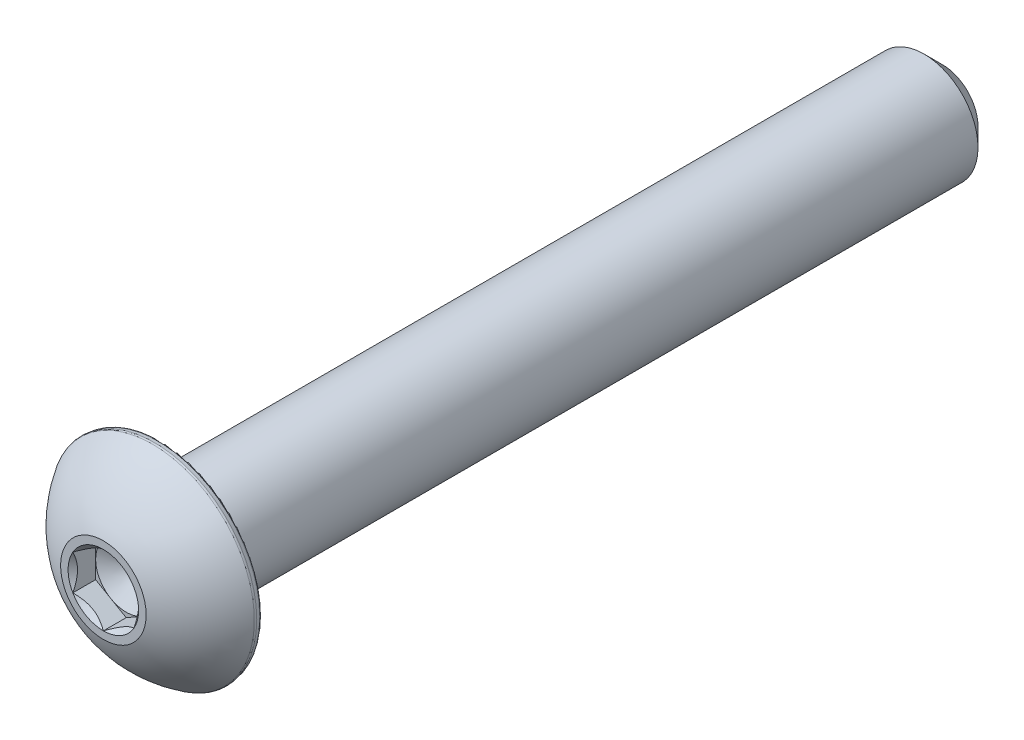
ISO-10303-21;
HEADER;
FILE_DESCRIPTION(('STEP AP214'),'2;1');
FILE_NAME('part.step','',(''),(''),'','','');
FILE_SCHEMA(('AUTOMOTIVE_DESIGN { 1 0 10303 214 1 1 1 1 }'));
ENDSEC;
DATA;
#1=APPLICATION_CONTEXT('core data for automotive mechanical design processes');
#2=APPLICATION_PROTOCOL_DEFINITION('international standard','automotive_design',2000,#1);
#3=PRODUCT_CONTEXT('',#1,'mechanical');
#4=PRODUCT('Part','Part','',(#3));
#5=PRODUCT_RELATED_PRODUCT_CATEGORY('part','',(#4));
#6=PRODUCT_DEFINITION_FORMATION('','',#4);
#7=PRODUCT_DEFINITION_CONTEXT('part definition',#1,'design');
#8=PRODUCT_DEFINITION('design','',#6,#7);
#9=PRODUCT_DEFINITION_SHAPE('','',#8);
#10=(LENGTH_UNIT() NAMED_UNIT(*) SI_UNIT(.MILLI.,.METRE.));
#11=(NAMED_UNIT(*) PLANE_ANGLE_UNIT() SI_UNIT($,.RADIAN.));
#12=(NAMED_UNIT(*) SI_UNIT($,.STERADIAN.) SOLID_ANGLE_UNIT());
#13=UNCERTAINTY_MEASURE_WITH_UNIT(LENGTH_MEASURE(1.E-05),#10,'distance_accuracy_value','');
#14=(GEOMETRIC_REPRESENTATION_CONTEXT(3) GLOBAL_UNCERTAINTY_ASSIGNED_CONTEXT((#13)) GLOBAL_UNIT_ASSIGNED_CONTEXT((#10,
#11,#12)) REPRESENTATION_CONTEXT('',''));
#15=CARTESIAN_POINT('',(0.,0.,0.));
#16=DIRECTION('',(0.,0.,1.));
#17=DIRECTION('',(1.,0.,0.));
#18=AXIS2_PLACEMENT_3D('',#15,#16,#17);
#19=CARTESIAN_POINT('',(0.,0.9921875,13.6271));
#20=DIRECTION('',(0.,0.,-1.));
#21=DIRECTION('',(-1.,0.,0.));
#22=AXIS2_PLACEMENT_3D('',#19,#20,#21);
#23=PLANE('',#22);
#24=CARTESIAN_POINT('',(0.,0.,13.6271));
#25=DIRECTION('',(0.,0.,1.));
#26=DIRECTION('',(1.,0.,0.));
#27=AXIS2_PLACEMENT_3D('',#24,#25,#26);
#28=CIRCLE('',#27,1.3890625);
#29=CARTESIAN_POINT('',(1.3890625,0.,13.6271));
#30=VERTEX_POINT('',#29);
#31=EDGE_CURVE('E167',#30,#30,#28,.T.);
#32=ORIENTED_EDGE('',*,*,#31,.T.);
#33=EDGE_LOOP('',(#32));
#34=FACE_BOUND('',#33,.T.);
#35=CARTESIAN_POINT('',(0.,0.,13.6271));
#36=DIRECTION('',(0.,0.,1.));
#37=DIRECTION('',(1.,0.,0.));
#38=AXIS2_PLACEMENT_3D('',#35,#36,#37);
#39=CIRCLE('',#38,1.14567944042316);
#40=CARTESIAN_POINT('',(0.,1.14567944042316,13.6271));
#41=VERTEX_POINT('',#40);
#42=CARTESIAN_POINT('',(-0.992187500000001,0.57283972021158,13.6271));
#43=VERTEX_POINT('',#42);
#44=EDGE_CURVE('E121',#41,#43,#39,.T.);
#45=ORIENTED_EDGE('',*,*,#44,.F.);
#46=CARTESIAN_POINT('',(0.,0.,13.6271));
#47=DIRECTION('',(0.,0.,1.));
#48=DIRECTION('',(1.,0.,0.));
#49=AXIS2_PLACEMENT_3D('',#46,#47,#48);
#50=CIRCLE('',#49,1.14567944042316);
#51=CARTESIAN_POINT('',(0.9921875,0.572839720211582,13.6271));
#52=VERTEX_POINT('',#51);
#53=EDGE_CURVE('E106',#52,#41,#50,.T.);
#54=ORIENTED_EDGE('',*,*,#53,.F.);
#55=CARTESIAN_POINT('',(0.,0.,13.6271));
#56=DIRECTION('',(0.,0.,1.));
#57=DIRECTION('',(1.,0.,0.));
#58=AXIS2_PLACEMENT_3D('',#55,#56,#57);
#59=CIRCLE('',#58,1.14567944042316);
#60=CARTESIAN_POINT('',(0.9921875,-0.572839720211582,13.6271));
#61=VERTEX_POINT('',#60);
#62=EDGE_CURVE('E117',#61,#52,#59,.T.);
#63=ORIENTED_EDGE('',*,*,#62,.F.);
#64=CARTESIAN_POINT('',(0.,0.,13.6271));
#65=DIRECTION('',(0.,0.,1.));
#66=DIRECTION('',(1.,0.,0.));
#67=AXIS2_PLACEMENT_3D('',#64,#65,#66);
#68=CIRCLE('',#67,1.14567944042316);
#69=CARTESIAN_POINT('',(0.,-1.14567944042316,13.6271));
#70=VERTEX_POINT('',#69);
#71=EDGE_CURVE('E138',#70,#61,#68,.T.);
#72=ORIENTED_EDGE('',*,*,#71,.F.);
#73=CARTESIAN_POINT('',(0.,0.,13.6271));
#74=DIRECTION('',(0.,0.,1.));
#75=DIRECTION('',(1.,0.,0.));
#76=AXIS2_PLACEMENT_3D('',#73,#74,#75);
#77=CIRCLE('',#76,1.14567944042316);
#78=CARTESIAN_POINT('',(-0.9921875,-0.572839720211582,13.6271));
#79=VERTEX_POINT('',#78);
#80=EDGE_CURVE('E540',#79,#70,#77,.T.);
#81=ORIENTED_EDGE('',*,*,#80,.F.);
#82=CARTESIAN_POINT('',(0.,0.,13.6271));
#83=DIRECTION('',(0.,0.,1.));
#84=DIRECTION('',(1.,0.,0.));
#85=AXIS2_PLACEMENT_3D('',#82,#83,#84);
#86=CIRCLE('',#85,1.14567944042316);
#87=EDGE_CURVE('E283',#43,#79,#86,.T.);
#88=ORIENTED_EDGE('',*,*,#87,.F.);
#89=EDGE_LOOP('',(#45,#54,#63,#72,#81,#88));
#90=FACE_BOUND('',#89,.T.);
#91=ADVANCED_FACE('F33',(#34,#90),#23,.F.);
#92=CARTESIAN_POINT('',(0.,0.,-13.6271));
#93=DIRECTION('',(0.,0.,1.));
#94=DIRECTION('',(1.,0.,0.));
#95=AXIS2_PLACEMENT_3D('',#92,#93,#94);
#96=CONICAL_SURFACE('',#95,1.1572875,0.785398163397445);
#97=CARTESIAN_POINT('',(0.,0.,-13.0317875));
#98=DIRECTION('',(0.,0.,1.));
#99=DIRECTION('',(1.,0.,0.));
#100=AXIS2_PLACEMENT_3D('',#97,#98,#99);
#101=CIRCLE('',#100,1.7526);
#102=CARTESIAN_POINT('',(1.7526,0.,-13.0317875));
#103=VERTEX_POINT('',#102);
#104=EDGE_CURVE('E174',#103,#103,#101,.T.);
#105=ORIENTED_EDGE('',*,*,#104,.F.);
#106=EDGE_LOOP('',(#105));
#107=FACE_BOUND('',#106,.T.);
#108=CARTESIAN_POINT('',(0.,0.,-13.6271));
#109=DIRECTION('',(0.,0.,1.));
#110=DIRECTION('',(1.,0.,0.));
#111=AXIS2_PLACEMENT_3D('',#108,#109,#110);
#112=CIRCLE('',#111,1.1572875);
#113=CARTESIAN_POINT('',(1.1572875,0.,-13.6271));
#114=VERTEX_POINT('',#113);
#115=EDGE_CURVE('E160',#114,#114,#112,.T.);
#116=ORIENTED_EDGE('',*,*,#115,.T.);
#117=EDGE_LOOP('',(#116));
#118=FACE_BOUND('',#117,.T.);
#119=ADVANCED_FACE('F211',(#107,#118),#96,.T.);
#120=CARTESIAN_POINT('',(0.,0.,13.6271));
#121=DIRECTION('',(0.,0.,1.));
#122=DIRECTION('',(1.,0.,0.));
#123=AXIS2_PLACEMENT_3D('',#120,#121,#122);
#124=CYLINDRICAL_SURFACE('',#123,1.7526);
#125=CARTESIAN_POINT('',(0.,0.,11.7729));
#126=DIRECTION('',(0.,0.,1.));
#127=DIRECTION('',(1.,0.,0.));
#128=AXIS2_PLACEMENT_3D('',#125,#126,#127);
#129=CIRCLE('',#128,1.7526);
#130=CARTESIAN_POINT('',(1.7526,0.,11.7729));
#131=VERTEX_POINT('',#130);
#132=EDGE_CURVE('E171',#131,#131,#129,.T.);
#133=ORIENTED_EDGE('',*,*,#132,.F.);
#134=EDGE_LOOP('',(#133));
#135=FACE_BOUND('',#134,.T.);
#136=ORIENTED_EDGE('',*,*,#104,.T.);
#137=EDGE_LOOP('',(#136));
#138=FACE_BOUND('',#137,.T.);
#139=ADVANCED_FACE('F216',(#135,#138),#124,.T.);
#140=CARTESIAN_POINT('',(0.,3.28741155973219,11.7729));
#141=DIRECTION('',(0.,0.,1.));
#142=DIRECTION('',(1.,0.,0.));
#143=AXIS2_PLACEMENT_3D('',#140,#141,#142);
#144=PLANE('',#143);
#145=CARTESIAN_POINT('',(0.,0.,11.7729));
#146=DIRECTION('',(0.,0.,1.));
#147=DIRECTION('',(1.,0.,0.));
#148=AXIS2_PLACEMENT_3D('',#145,#146,#147);
#149=CIRCLE('',#148,3.20961863292574);
#150=CARTESIAN_POINT('',(3.20961863292574,0.,11.7729));
#151=VERTEX_POINT('',#150);
#152=EDGE_CURVE('E41',#151,#151,#149,.F.);
#153=ORIENTED_EDGE('',*,*,#152,.T.);
#154=EDGE_LOOP('',(#153));
#155=FACE_BOUND('',#154,.T.);
#156=ORIENTED_EDGE('',*,*,#132,.T.);
#157=EDGE_LOOP('',(#156));
#158=FACE_BOUND('',#157,.T.);
#159=ADVANCED_FACE('F185',(#155,#158),#144,.F.);
#160=CARTESIAN_POINT('',(0.,0.,11.7729));
#161=DIRECTION('',(0.,0.,1.));
#162=DIRECTION('',(1.,0.,0.));
#163=AXIS2_PLACEMENT_3D('',#160,#161,#162);
#164=CONICAL_SURFACE('',#163,3.28741155973219,0.174532925199426);
#165=CARTESIAN_POINT('',(0.,0.,11.8495110774485));
#166=DIRECTION('',(0.,0.,-1.));
#167=DIRECTION('',(-1.,0.,0.));
#168=AXIS2_PLACEMENT_3D('',#165,#166,#167);
#169=CIRCLE('',#168,3.30092015970751);
#170=CARTESIAN_POINT('',(-3.30092015970751,0.,11.8495110774485));
#171=VERTEX_POINT('',#170);
#172=EDGE_CURVE('E180',#171,#171,#169,.F.);
#173=ORIENTED_EDGE('',*,*,#172,.T.);
#174=EDGE_LOOP('',(#173));
#175=FACE_BOUND('',#174,.T.);
#176=CARTESIAN_POINT('',(0.,0.,11.965362863037));
#177=DIRECTION('',(0.,0.,-1.));
#178=DIRECTION('',(-1.,0.,0.));
#179=AXIS2_PLACEMENT_3D('',#176,#177,#178);
#180=CIRCLE('',#179,3.32134795527);
#181=CARTESIAN_POINT('',(-3.32134795527,0.,11.965362863037));
#182=VERTEX_POINT('',#181);
#183=EDGE_CURVE('E177',#182,#182,#180,.T.);
#184=ORIENTED_EDGE('',*,*,#183,.T.);
#185=EDGE_LOOP('',(#184));
#186=FACE_BOUND('',#185,.T.);
#187=ADVANCED_FACE('F193',(#175,#186),#164,.T.);
#188=CARTESIAN_POINT('',(0.,0.,10.0046132454163));
#189=DIRECTION('',(0.,0.,1.));
#190=DIRECTION('',(0.,1.,0.));
#191=AXIS2_PLACEMENT_3D('',#188,#189,#190);
#192=SPHERICAL_SURFACE('',#191,3.87967845523838);
#193=CARTESIAN_POINT('',(0.,0.,12.029857654296));
#194=DIRECTION('',(0.,0.,-1.));
#195=DIRECTION('',(-1.,0.,0.));
#196=AXIS2_PLACEMENT_3D('',#193,#194,#195);
#197=CIRCLE('',#196,3.30912224016312);
#198=CARTESIAN_POINT('',(-3.30912224016312,0.,12.029857654296));
#199=VERTEX_POINT('',#198);
#200=EDGE_CURVE('E11',#199,#199,#197,.F.);
#201=ORIENTED_EDGE('',*,*,#200,.T.);
#202=EDGE_LOOP('',(#201));
#203=FACE_BOUND('',#202,.T.);
#204=ORIENTED_EDGE('',*,*,#31,.F.);
#205=EDGE_LOOP('',(#204));
#206=FACE_BOUND('',#205,.T.);
#207=ADVANCED_FACE('F196',(#203,#206),#192,.T.);
#208=CARTESIAN_POINT('',(0.,1.1572875,-13.6271));
#209=DIRECTION('',(0.,0.,1.));
#210=DIRECTION('',(1.,0.,0.));
#211=AXIS2_PLACEMENT_3D('',#208,#209,#210);
#212=PLANE('',#211);
#213=ORIENTED_EDGE('',*,*,#115,.F.);
#214=EDGE_LOOP('',(#213));
#215=FACE_BOUND('',#214,.T.);
#216=ADVANCED_FACE('F206',(#215),#212,.F.);
#217=CARTESIAN_POINT('',(0.9921875,0.572839720211583,13.6271));
#218=DIRECTION('',(-0.5,-0.866025403784439,0.));
#219=DIRECTION('',(0.866025403784439,-0.5,0.));
#220=AXIS2_PLACEMENT_3D('',#217,#218,#219);
#221=PLANE('',#220);
#222=CARTESIAN_POINT('',(0.9923875,0.572724250157745,13.627215487509));
#223=CARTESIAN_POINT('',(0.958273424767844,0.592420020676185,13.6075328114047));
#224=CARTESIAN_POINT('',(0.923588910507721,0.612445134320979,13.5890056845184));
#225=CARTESIAN_POINT('',(0.852862918800041,0.65327880467211,13.5550823296504));
#226=CARTESIAN_POINT('',(0.816814708375758,0.674091248664374,13.5397049872309));
#227=CARTESIAN_POINT('',(0.744124988262605,0.716058678139022,13.5133631427343));
#228=CARTESIAN_POINT('',(0.707502010986799,0.737202963927734,13.5023323965131));
#229=CARTESIAN_POINT('',(0.633449993753944,0.779956916011157,13.4853362056729));
#230=CARTESIAN_POINT('',(0.596023217440658,0.801565275390533,13.4793580675789));
#231=CARTESIAN_POINT('',(0.53152286139453,0.838804573316592,13.4739663449143));
#232=CARTESIAN_POINT('',(0.504533200685471,0.854387061192303,13.4731689963883));
#233=CARTESIAN_POINT('',(0.450606144054337,0.885521861854893,13.4745081933614));
#234=CARTESIAN_POINT('',(0.423668760975761,0.901074167226573,13.476645386137));
#235=CARTESIAN_POINT('',(0.343241277041503,0.947508996726261,13.487317571306));
#236=CARTESIAN_POINT('',(0.290151430636718,0.9781604338393,13.5001143807227));
#237=CARTESIAN_POINT('',(0.196972862034203,1.03195710550467,13.5309974676501));
#238=CARTESIAN_POINT('',(0.156447193690484,1.055354611032,13.5474650089077));
#239=CARTESIAN_POINT('',(0.0769831842917925,1.10123317824922,13.5845603835568));
#240=CARTESIAN_POINT('',(0.0380401617384759,1.12371694280344,13.6051746806455));
#241=CARTESIAN_POINT('',(-0.000200000000000987,1.145794910477,13.627215487509));
#242=B_SPLINE_CURVE_WITH_KNOTS('',3,(#222,#223,#224,#225,#226,#227,#228,#229,#230,#231,#232,
#233,#234,#235,#236,#237,#238,#239,#240,#241),.UNSPECIFIED.,.F.,.F.,(4,2,2,2,2,2,2,2,2,4),(0.,
0.13219718521019,0.265165186853262,0.396020097605669,0.526545281028573,0.619935205043264,
0.713345731536163,0.900220051846368,1.04884529769095,1.1969930355767),.UNSPECIFIED.);
#243=EDGE_CURVE('E103',#52,#41,#242,.T.);
#244=ORIENTED_EDGE('',*,*,#243,.T.);
#245=DIRECTION('',(0.,0.,-1.));
#246=VECTOR('',#245,1.);
#247=CARTESIAN_POINT('',(0.,1.14567944042316,13.6271));
#248=LINE('',#247,#246);
#249=CARTESIAN_POINT('',(0.,1.14567944042316,12.88542));
#250=VERTEX_POINT('',#249);
#251=EDGE_CURVE('E158',#41,#250,#248,.T.);
#252=ORIENTED_EDGE('',*,*,#251,.T.);
#253=DIRECTION('',(-0.866025403784439,0.5,0.));
#254=VECTOR('',#253,1.);
#255=CARTESIAN_POINT('',(0.9921875,0.572839720211583,12.88542));
#256=LINE('',#255,#254);
#257=CARTESIAN_POINT('',(0.496093749999999,0.859259580317373,12.88542));
#258=VERTEX_POINT('',#257);
#259=EDGE_CURVE('E286',#258,#250,#256,.T.);
#260=ORIENTED_EDGE('',*,*,#259,.F.);
#261=CARTESIAN_POINT('',(0.9921875,0.572839720211583,12.88542));
#262=VERTEX_POINT('',#261);
#263=EDGE_CURVE('E48',#262,#258,#256,.T.);
#264=ORIENTED_EDGE('',*,*,#263,.F.);
#265=DIRECTION('',(0.,0.,-1.));
#266=VECTOR('',#265,1.);
#267=CARTESIAN_POINT('',(0.9921875,0.572839720211583,13.6271));
#268=LINE('',#267,#266);
#269=EDGE_CURVE('E134',#52,#262,#268,.T.);
#270=ORIENTED_EDGE('',*,*,#269,.F.);
#271=EDGE_LOOP('',(#244,#252,#260,#264,#270));
#272=FACE_BOUND('',#271,.T.);
#273=ADVANCED_FACE('F140',(#272),#221,.T.);
#274=CARTESIAN_POINT('',(0.,1.14567944042316,13.6271));
#275=DIRECTION('',(0.500000000000001,-0.866025403784438,0.));
#276=DIRECTION('',(0.866025403784438,0.500000000000001,0.));
#277=AXIS2_PLACEMENT_3D('',#274,#275,#276);
#278=PLANE('',#277);
#279=CARTESIAN_POINT('',(0.000199999999999419,1.145794910477,13.627215487509));
#280=CARTESIAN_POINT('',(-0.0339140752321569,1.12609913995856,13.6075328114047));
#281=CARTESIAN_POINT('',(-0.0685985894922812,1.10607402631377,13.5890056845184));
#282=CARTESIAN_POINT('',(-0.139324581199961,1.06524035596263,13.5550823296504));
#283=CARTESIAN_POINT('',(-0.175372791624244,1.04442791197037,13.5397049872309));
#284=CARTESIAN_POINT('',(-0.248062511737398,1.00246048249572,13.5133631427343));
#285=CARTESIAN_POINT('',(-0.284685489013203,0.981316196707011,13.5023323965131));
#286=CARTESIAN_POINT('',(-0.358737506246059,0.938562244623587,13.4853362056729));
#287=CARTESIAN_POINT('',(-0.396164282559345,0.916953885244211,13.4793580675789));
#288=CARTESIAN_POINT('',(-0.460664638605473,0.879714587318152,13.4739663449143));
#289=CARTESIAN_POINT('',(-0.487654299314532,0.864132099442441,13.4731689963883));
#290=CARTESIAN_POINT('',(-0.541581355945667,0.832997298779851,13.4745081933614));
#291=CARTESIAN_POINT('',(-0.568518739024242,0.817444993408171,13.476645386137));
#292=CARTESIAN_POINT('',(-0.6489462229585,0.771010163908483,13.487317571306));
#293=CARTESIAN_POINT('',(-0.702036069363285,0.740358726795444,13.5001143807227));
#294=CARTESIAN_POINT('',(-0.7952146379658,0.686562055130078,13.5309974676501));
#295=CARTESIAN_POINT('',(-0.835740306309519,0.663164549602743,13.5474650089077));
#296=CARTESIAN_POINT('',(-0.915204315708209,0.617285982385521,13.5845603835568));
#297=CARTESIAN_POINT('',(-0.954147338261525,0.594802217831307,13.6051746806455));
#298=CARTESIAN_POINT('',(-0.992387500000001,0.572724250157743,13.627215487509));
#299=B_SPLINE_CURVE_WITH_KNOTS('',3,(#279,#280,#281,#282,#283,#284,#285,#286,#287,#288,#289,
#290,#291,#292,#293,#294,#295,#296,#297,#298),.UNSPECIFIED.,.F.,.F.,(4,2,2,2,2,2,2,2,2,4),(0.,
0.132197185210193,0.265165186853265,0.396020097605672,0.526545281028576,0.619935205043267,
0.713345731536167,0.900220051846372,1.04884529769095,1.1969930355767),.UNSPECIFIED.);
#300=EDGE_CURVE('E274',#41,#43,#299,.T.);
#301=ORIENTED_EDGE('',*,*,#300,.T.);
#302=DIRECTION('',(0.,0.,-1.));
#303=VECTOR('',#302,1.);
#304=CARTESIAN_POINT('',(-0.992187500000001,0.572839720211581,13.6271));
#305=LINE('',#304,#303);
#306=CARTESIAN_POINT('',(-0.992187500000001,0.572839720211581,12.88542));
#307=VERTEX_POINT('',#306);
#308=EDGE_CURVE('E155',#43,#307,#305,.T.);
#309=ORIENTED_EDGE('',*,*,#308,.T.);
#310=DIRECTION('',(-0.866025403784438,-0.500000000000001,0.));
#311=VECTOR('',#310,1.);
#312=CARTESIAN_POINT('',(0.,1.14567944042316,12.88542));
#313=LINE('',#312,#311);
#314=CARTESIAN_POINT('',(-0.496093750000001,0.859259580317373,12.88542));
#315=VERTEX_POINT('',#314);
#316=EDGE_CURVE('E288',#315,#307,#313,.T.);
#317=ORIENTED_EDGE('',*,*,#316,.F.);
#318=EDGE_CURVE('E289',#250,#315,#313,.T.);
#319=ORIENTED_EDGE('',*,*,#318,.F.);
#320=ORIENTED_EDGE('',*,*,#251,.F.);
#321=EDGE_LOOP('',(#301,#309,#317,#319,#320));
#322=FACE_BOUND('',#321,.T.);
#323=ADVANCED_FACE('F239',(#322),#278,.T.);
#324=CARTESIAN_POINT('',(-0.992187500000001,0.572839720211581,13.6271));
#325=DIRECTION('',(1.,0.,0.));
#326=DIRECTION('',(0.,1.,0.));
#327=AXIS2_PLACEMENT_3D('',#324,#325,#326);
#328=PLANE('',#327);
#329=CARTESIAN_POINT('',(-0.9921875,-1.10949418891906,13.9698470409327));
#330=CARTESIAN_POINT('',(-0.9921875,-1.0823248648886,13.9495977650143));
#331=CARTESIAN_POINT('',(-0.9921875,-1.0550006408226,13.9295568710457));
#332=CARTESIAN_POINT('',(-0.9921875,-0.999980792873914,13.8899768868049));
#333=CARTESIAN_POINT('',(-0.9921875,-0.972285074627779,13.8704379278497));
#334=CARTESIAN_POINT('',(-0.9921875,-0.888143426458247,13.8124234554565));
#335=CARTESIAN_POINT('',(-0.9921875,-0.831056182145668,13.7748623928985));
#336=CARTESIAN_POINT('',(-0.9921875,-0.711554440354375,13.7014195358545));
#337=CARTESIAN_POINT('',(-0.9921875,-0.649018130618403,13.6657335899983));
#338=CARTESIAN_POINT('',(-0.9921875,-0.520865585622979,13.6006639049752));
#339=CARTESIAN_POINT('',(-0.9921875,-0.455260644614128,13.5712589787957));
#340=CARTESIAN_POINT('',(-0.9921875,-0.35646448736768,13.5352954983595));
#341=CARTESIAN_POINT('',(-0.9921875,-0.324666846387041,13.5249208050058));
#342=CARTESIAN_POINT('',(-0.9921875,-0.26033277698824,13.5067288358135));
#343=CARTESIAN_POINT('',(-0.9921875,-0.227796295081892,13.4989117457672));
#344=CARTESIAN_POINT('',(-0.9921875,-0.162712405358303,13.4863637547531));
#345=CARTESIAN_POINT('',(-0.9921875,-0.130175055255582,13.4815814793169));
#346=CARTESIAN_POINT('',(-0.9921875,-0.0647778707960089,13.4751881200598));
#347=CARTESIAN_POINT('',(-0.992187500000001,-0.0319179811139638,13.4735775901906));
#348=CARTESIAN_POINT('',(-0.992187500000001,0.0327400524007124,13.4736384241559));
#349=CARTESIAN_POINT('',(-0.992187500000001,0.0645383411726862,13.4752058628384));
#350=CARTESIAN_POINT('',(-0.992187500000001,0.127849181023788,13.4813145432134));
#351=CARTESIAN_POINT('',(-0.992187500000001,0.159361674088216,13.4858563755709));
#352=CARTESIAN_POINT('',(-0.992187500000001,0.222401055147185,13.4977486114099));
#353=CARTESIAN_POINT('',(-0.992187500000001,0.25391903049348,13.5051455740016));
#354=CARTESIAN_POINT('',(-0.992187500000001,0.316270119305014,13.5223649633627));
#355=CARTESIAN_POINT('',(-0.992187500000001,0.347103300686062,13.5321871484245));
#356=CARTESIAN_POINT('',(-0.992187500000001,0.445747348418668,13.567264086148));
#357=CARTESIAN_POINT('',(-0.992187500000001,0.512111869884733,13.5965775702976));
#358=CARTESIAN_POINT('',(-0.992187500000001,0.641707751633624,13.6617033241341));
#359=CARTESIAN_POINT('',(-0.992187500000001,0.704926593628331,13.697539267595));
#360=CARTESIAN_POINT('',(-0.992187500000001,0.825720927781168,13.7714181448275));
#361=CARTESIAN_POINT('',(-0.992187500000001,0.883420488382574,13.8092606988511));
#362=CARTESIAN_POINT('',(-0.992187500000001,0.968430125783475,13.8677387372263));
#363=CARTESIAN_POINT('',(-0.992187500000001,0.996398939377162,13.8874332531538));
#364=CARTESIAN_POINT('',(-0.992187500000001,1.05195567836533,13.9273371742085));
#365=CARTESIAN_POINT('',(-0.992187500000001,1.07954370555033,13.9475464374577));
#366=CARTESIAN_POINT('',(-0.992187500000001,1.10697339818653,13.9679689575272));
#367=B_SPLINE_CURVE_WITH_KNOTS('',3,(#329,#330,#331,#332,#333,#334,#335,#336,#337,#338,#339,
#340,#341,#342,#343,#344,#345,#346,#347,#348,#349,#350,#351,#352,#353,#354,#355,#356,#357,#358,
#359,#360,#361,#362,#363,#364,#365,#366),.UNSPECIFIED.,.F.,.F.,(4,2,2,2,2,2,2,2,2,2,2,2,2,2,2,2,
2,2,4),(0.,0.10165285617456,0.2033320415304,0.408242719174564,0.624062035020539,
0.839141436739499,0.939397795991985,1.0396614365623,1.1381790118448,1.23671379188978,
1.332078293144,1.42746173794517,1.52447122946096,1.62147105651117,1.83847882513562,
2.0562905439946,2.26319512011788,2.36581270183829,2.46840229912001),.UNSPECIFIED.);
#368=EDGE_CURVE('E282',#43,#79,#367,.F.);
#369=ORIENTED_EDGE('',*,*,#368,.T.);
#370=DIRECTION('',(0.,0.,-1.));
#371=VECTOR('',#370,1.);
#372=CARTESIAN_POINT('',(-0.9921875,-0.572839720211582,13.6271));
#373=LINE('',#372,#371);
#374=CARTESIAN_POINT('',(-0.9921875,-0.572839720211582,12.88542));
#375=VERTEX_POINT('',#374);
#376=EDGE_CURVE('E152',#79,#375,#373,.T.);
#377=ORIENTED_EDGE('',*,*,#376,.T.);
#378=DIRECTION('',(0.,-1.,0.));
#379=VECTOR('',#378,1.);
#380=CARTESIAN_POINT('',(-0.992187500000001,0.572839720211581,12.88542));
#381=LINE('',#380,#379);
#382=CARTESIAN_POINT('',(-0.992187500000001,0.,12.88542));
#383=VERTEX_POINT('',#382);
#384=EDGE_CURVE('E292',#383,#375,#381,.T.);
#385=ORIENTED_EDGE('',*,*,#384,.F.);
#386=EDGE_CURVE('E293',#307,#383,#381,.T.);
#387=ORIENTED_EDGE('',*,*,#386,.F.);
#388=ORIENTED_EDGE('',*,*,#308,.F.);
#389=EDGE_LOOP('',(#369,#377,#385,#387,#388));
#390=FACE_BOUND('',#389,.T.);
#391=ADVANCED_FACE('F244',(#390),#328,.T.);
#392=CARTESIAN_POINT('',(-0.9921875,-0.572839720211582,13.6271));
#393=DIRECTION('',(0.499999999999999,0.866025403784439,0.));
#394=DIRECTION('',(-0.866025403784439,0.499999999999999,0.));
#395=AXIS2_PLACEMENT_3D('',#392,#393,#394);
#396=PLANE('',#395);
#397=CARTESIAN_POINT('',(-0.9923875,-0.572724250157744,13.627215487509));
#398=CARTESIAN_POINT('',(-0.958273424767844,-0.592420020676184,13.6075328114047));
#399=CARTESIAN_POINT('',(-0.92358891050772,-0.612445134320978,13.5890056845184));
#400=CARTESIAN_POINT('',(-0.85286291880004,-0.653278804672111,13.5550823296504));
#401=CARTESIAN_POINT('',(-0.816814708375757,-0.674091248664375,13.5397049872309));
#402=CARTESIAN_POINT('',(-0.744124988262603,-0.716058678139022,13.5133631427343));
#403=CARTESIAN_POINT('',(-0.707502010986798,-0.737202963927734,13.5023323965131));
#404=CARTESIAN_POINT('',(-0.633449993753942,-0.779956916011158,13.4853362056729));
#405=CARTESIAN_POINT('',(-0.596023217440656,-0.801565275390534,13.4793580675789));
#406=CARTESIAN_POINT('',(-0.531522861394528,-0.838804573316593,13.4739663449143));
#407=CARTESIAN_POINT('',(-0.504533200685469,-0.854387061192304,13.4731689963883));
#408=CARTESIAN_POINT('',(-0.450606144054334,-0.885521861854894,13.4745081933614));
#409=CARTESIAN_POINT('',(-0.423668760975759,-0.901074167226574,13.476645386137));
#410=CARTESIAN_POINT('',(-0.343241277041501,-0.947508996726261,13.487317571306));
#411=CARTESIAN_POINT('',(-0.290151430636716,-0.9781604338393,13.5001143807227));
#412=CARTESIAN_POINT('',(-0.196972862034201,-1.03195710550467,13.5309974676501));
#413=CARTESIAN_POINT('',(-0.156447193690483,-1.055354611032,13.5474650089077));
#414=CARTESIAN_POINT('',(-0.0769831842917922,-1.10123317824922,13.5845603835568));
#415=CARTESIAN_POINT('',(-0.0380401617384761,-1.12371694280344,13.6051746806455));
#416=CARTESIAN_POINT('',(0.000200000000000467,-1.145794910477,13.627215487509));
#417=B_SPLINE_CURVE_WITH_KNOTS('',3,(#397,#398,#399,#400,#401,#402,#403,#404,#405,#406,#407,
#408,#409,#410,#411,#412,#413,#414,#415,#416),.UNSPECIFIED.,.F.,.F.,(4,2,2,2,2,2,2,2,2,4),(0.,
0.132197185210192,0.265165186853264,0.396020097605671,0.526545281028576,0.619935205043267,
0.713345731536167,0.900220051846371,1.04884529769095,1.1969930355767),.UNSPECIFIED.);
#418=EDGE_CURVE('E542',#79,#70,#417,.T.);
#419=ORIENTED_EDGE('',*,*,#418,.T.);
#420=DIRECTION('',(0.,0.,-1.));
#421=VECTOR('',#420,1.);
#422=CARTESIAN_POINT('',(0.,-1.14567944042316,13.6271));
#423=LINE('',#422,#421);
#424=CARTESIAN_POINT('',(0.,-1.14567944042316,12.88542));
#425=VERTEX_POINT('',#424);
#426=EDGE_CURVE('E143',#70,#425,#423,.T.);
#427=ORIENTED_EDGE('',*,*,#426,.T.);
#428=DIRECTION('',(0.866025403784439,-0.499999999999999,0.));
#429=VECTOR('',#428,1.);
#430=CARTESIAN_POINT('',(-0.9921875,-0.572839720211582,12.88542));
#431=LINE('',#430,#429);
#432=CARTESIAN_POINT('',(-0.496093749999999,-0.859259580317373,12.88542));
#433=VERTEX_POINT('',#432);
#434=EDGE_CURVE('E296',#433,#425,#431,.T.);
#435=ORIENTED_EDGE('',*,*,#434,.F.);
#436=EDGE_CURVE('E297',#375,#433,#431,.T.);
#437=ORIENTED_EDGE('',*,*,#436,.F.);
#438=ORIENTED_EDGE('',*,*,#376,.F.);
#439=EDGE_LOOP('',(#419,#427,#435,#437,#438));
#440=FACE_BOUND('',#439,.T.);
#441=ADVANCED_FACE('F248',(#440),#396,.T.);
#442=CARTESIAN_POINT('',(0.,-1.14567944042316,13.6271));
#443=DIRECTION('',(-0.5,0.866025403784438,0.));
#444=DIRECTION('',(-0.866025403784438,-0.5,0.));
#445=AXIS2_PLACEMENT_3D('',#442,#443,#444);
#446=PLANE('',#445);
#447=CARTESIAN_POINT('',(-0.000199999999998939,-1.145794910477,13.627215487509));
#448=CARTESIAN_POINT('',(0.0339140752321572,-1.12609913995856,13.6075328114047));
#449=CARTESIAN_POINT('',(0.0685985894922809,-1.10607402631377,13.5890056845184));
#450=CARTESIAN_POINT('',(0.13932458119996,-1.06524035596263,13.5550823296504));
#451=CARTESIAN_POINT('',(0.175372791624243,-1.04442791197037,13.5397049872309));
#452=CARTESIAN_POINT('',(0.248062511737397,-1.00246048249572,13.5133631427343));
#453=CARTESIAN_POINT('',(0.284685489013202,-0.981316196707011,13.5023323965131));
#454=CARTESIAN_POINT('',(0.358737506246057,-0.938562244623587,13.4853362056729));
#455=CARTESIAN_POINT('',(0.396164282559343,-0.916953885244212,13.4793580675789));
#456=CARTESIAN_POINT('',(0.460664638605471,-0.879714587318153,13.4739663449143));
#457=CARTESIAN_POINT('',(0.487654299314529,-0.864132099442441,13.4731689963883));
#458=CARTESIAN_POINT('',(0.541581355945664,-0.832997298779852,13.4745081933614));
#459=CARTESIAN_POINT('',(0.56851873902424,-0.817444993408172,13.476645386137));
#460=CARTESIAN_POINT('',(0.648946222958497,-0.771010163908484,13.487317571306));
#461=CARTESIAN_POINT('',(0.702036069363282,-0.740358726795445,13.5001143807227));
#462=CARTESIAN_POINT('',(0.795214637965797,-0.686562055130079,13.5309974676501));
#463=CARTESIAN_POINT('',(0.835740306309516,-0.663164549602744,13.5474650089077));
#464=CARTESIAN_POINT('',(0.915204315708207,-0.617285982385523,13.5845603835568));
#465=CARTESIAN_POINT('',(0.954147338261523,-0.594802217831308,13.6051746806455));
#466=CARTESIAN_POINT('',(0.992387499999999,-0.572724250157744,13.627215487509));
#467=B_SPLINE_CURVE_WITH_KNOTS('',3,(#447,#448,#449,#450,#451,#452,#453,#454,#455,#456,#457,
#458,#459,#460,#461,#462,#463,#464,#465,#466),.UNSPECIFIED.,.F.,.F.,(4,2,2,2,2,2,2,2,2,4),(0.,
0.132197185210191,0.265165186853263,0.396020097605669,0.526545281028573,0.619935205043263,
0.713345731536163,0.900220051846368,1.04884529769095,1.19699303557669),.UNSPECIFIED.);
#468=EDGE_CURVE('E309',#70,#61,#467,.T.);
#469=ORIENTED_EDGE('',*,*,#468,.T.);
#470=DIRECTION('',(0.,0.,-1.));
#471=VECTOR('',#470,1.);
#472=CARTESIAN_POINT('',(0.9921875,-0.572839720211581,13.6271));
#473=LINE('',#472,#471);
#474=CARTESIAN_POINT('',(0.9921875,-0.572839720211581,12.88542));
#475=VERTEX_POINT('',#474);
#476=EDGE_CURVE('E137',#61,#475,#473,.T.);
#477=ORIENTED_EDGE('',*,*,#476,.T.);
#478=DIRECTION('',(0.866025403784438,0.5,0.));
#479=VECTOR('',#478,1.);
#480=CARTESIAN_POINT('',(0.,-1.14567944042316,12.88542));
#481=LINE('',#480,#479);
#482=CARTESIAN_POINT('',(0.49609375,-0.859259580317372,12.88542));
#483=VERTEX_POINT('',#482);
#484=EDGE_CURVE('E299',#483,#475,#481,.T.);
#485=ORIENTED_EDGE('',*,*,#484,.F.);
#486=EDGE_CURVE('E300',#425,#483,#481,.T.);
#487=ORIENTED_EDGE('',*,*,#486,.F.);
#488=ORIENTED_EDGE('',*,*,#426,.F.);
#489=EDGE_LOOP('',(#469,#477,#485,#487,#488));
#490=FACE_BOUND('',#489,.T.);
#491=ADVANCED_FACE('F252',(#490),#446,.T.);
#492=CARTESIAN_POINT('',(0.9921875,-0.572839720211581,13.6271));
#493=DIRECTION('',(-1.,0.,0.));
#494=DIRECTION('',(0.,-1.,0.));
#495=AXIS2_PLACEMENT_3D('',#492,#493,#494);
#496=PLANE('',#495);
#497=CARTESIAN_POINT('',(0.9921875,-1.10949418891906,13.9698470409327));
#498=CARTESIAN_POINT('',(0.9921875,-1.08232486488861,13.9495977650143));
#499=CARTESIAN_POINT('',(0.9921875,-1.0550006408226,13.9295568710457));
#500=CARTESIAN_POINT('',(0.9921875,-0.999980792873915,13.8899768868049));
#501=CARTESIAN_POINT('',(0.9921875,-0.972285074627781,13.8704379278497));
#502=CARTESIAN_POINT('',(0.9921875,-0.888143426458248,13.8124234554565));
#503=CARTESIAN_POINT('',(0.9921875,-0.831056182145669,13.7748623928985));
#504=CARTESIAN_POINT('',(0.9921875,-0.711554440354376,13.7014195358545));
#505=CARTESIAN_POINT('',(0.9921875,-0.649018130618404,13.6657335899983));
#506=CARTESIAN_POINT('',(0.9921875,-0.520865585622981,13.6006639049752));
#507=CARTESIAN_POINT('',(0.9921875,-0.45526064461413,13.5712589787957));
#508=CARTESIAN_POINT('',(0.9921875,-0.356464487367681,13.5352954983595));
#509=CARTESIAN_POINT('',(0.9921875,-0.324666846387042,13.5249208050058));
#510=CARTESIAN_POINT('',(0.9921875,-0.260332776988242,13.5067288358135));
#511=CARTESIAN_POINT('',(0.9921875,-0.227796295081893,13.4989117457672));
#512=CARTESIAN_POINT('',(0.9921875,-0.162712405358304,13.4863637547531));
#513=CARTESIAN_POINT('',(0.9921875,-0.130175055255583,13.4815814793169));
#514=CARTESIAN_POINT('',(0.9921875,-0.06477787079601,13.4751881200598));
#515=CARTESIAN_POINT('',(0.9921875,-0.0319179811139649,13.4735775901906));
#516=CARTESIAN_POINT('',(0.9921875,0.0327400524007114,13.4736384241559));
#517=CARTESIAN_POINT('',(0.9921875,0.0645383411726853,13.4752058628384));
#518=CARTESIAN_POINT('',(0.9921875,0.127849181023787,13.4813145432134));
#519=CARTESIAN_POINT('',(0.9921875,0.159361674088216,13.4858563755709));
#520=CARTESIAN_POINT('',(0.9921875,0.222401055147184,13.4977486114099));
#521=CARTESIAN_POINT('',(0.9921875,0.253919030493479,13.5051455740016));
#522=CARTESIAN_POINT('',(0.9921875,0.316270119305013,13.5223649633627));
#523=CARTESIAN_POINT('',(0.9921875,0.347103300686061,13.5321871484245));
#524=CARTESIAN_POINT('',(0.9921875,0.445747348418669,13.567264086148));
#525=CARTESIAN_POINT('',(0.9921875,0.512111869884733,13.5965775702976));
#526=CARTESIAN_POINT('',(0.9921875,0.641707751633623,13.6617033241341));
#527=CARTESIAN_POINT('',(0.9921875,0.704926593628331,13.697539267595));
#528=CARTESIAN_POINT('',(0.9921875,0.825720927781167,13.7714181448275));
#529=CARTESIAN_POINT('',(0.9921875,0.883420488382573,13.8092606988511));
#530=CARTESIAN_POINT('',(0.9921875,0.968430125783475,13.8677387372263));
#531=CARTESIAN_POINT('',(0.9921875,0.996398939377163,13.8874332531538));
#532=CARTESIAN_POINT('',(0.9921875,1.05195567836533,13.9273371742085));
#533=CARTESIAN_POINT('',(0.9921875,1.07954370555034,13.9475464374577));
#534=CARTESIAN_POINT('',(0.9921875,1.10697339818653,13.9679689575272));
#535=B_SPLINE_CURVE_WITH_KNOTS('',3,(#497,#498,#499,#500,#501,#502,#503,#504,#505,#506,#507,
#508,#509,#510,#511,#512,#513,#514,#515,#516,#517,#518,#519,#520,#521,#522,#523,#524,#525,#526,
#527,#528,#529,#530,#531,#532,#533,#534),.UNSPECIFIED.,.F.,.F.,(4,2,2,2,2,2,2,2,2,2,2,2,2,2,2,2,
2,2,4),(0.,0.101652856174561,0.203332041530402,0.408242719174564,0.62406203502054,
0.8391414367395,0.939397795991986,1.0396614365623,1.1381790118448,1.23671379188978,
1.332078293144,1.42746173794517,1.52447122946096,1.62147105651117,1.83847882513562,
2.05629054399461,2.26319512011788,2.36581270183829,2.46840229912002),.UNSPECIFIED.);
#536=EDGE_CURVE('E127',#61,#52,#535,.T.);
#537=ORIENTED_EDGE('',*,*,#536,.T.);
#538=ORIENTED_EDGE('',*,*,#269,.T.);
#539=DIRECTION('',(0.,1.,0.));
#540=VECTOR('',#539,1.);
#541=CARTESIAN_POINT('',(0.9921875,-0.572839720211581,12.88542));
#542=LINE('',#541,#540);
#543=CARTESIAN_POINT('',(0.9921875,0.,12.88542));
#544=VERTEX_POINT('',#543);
#545=EDGE_CURVE('E146',#544,#262,#542,.T.);
#546=ORIENTED_EDGE('',*,*,#545,.F.);
#547=EDGE_CURVE('E141',#475,#544,#542,.T.);
#548=ORIENTED_EDGE('',*,*,#547,.F.);
#549=ORIENTED_EDGE('',*,*,#476,.F.);
#550=EDGE_LOOP('',(#537,#538,#546,#548,#549));
#551=FACE_BOUND('',#550,.T.);
#552=ADVANCED_FACE('F132',(#551),#496,.T.);
#553=CARTESIAN_POINT('',(0.,0.,12.88542));
#554=DIRECTION('',(0.,0.,1.));
#555=DIRECTION('',(1.,0.,0.));
#556=AXIS2_PLACEMENT_3D('',#553,#554,#555);
#557=PLANE('',#556);
#558=CARTESIAN_POINT('',(0.,0.,12.88542));
#559=DIRECTION('',(0.,0.,1.));
#560=DIRECTION('',(1.,0.,0.));
#561=AXIS2_PLACEMENT_3D('',#558,#559,#560);
#562=CIRCLE('',#561,0.9921875);
#563=EDGE_CURVE('E163',#483,#544,#562,.T.);
#564=ORIENTED_EDGE('',*,*,#563,.F.);
#565=ORIENTED_EDGE('',*,*,#484,.T.);
#566=ORIENTED_EDGE('',*,*,#547,.T.);
#567=EDGE_LOOP('',(#564,#565,#566));
#568=FACE_BOUND('',#567,.T.);
#569=ADVANCED_FACE('F259',(#568),#557,.T.);
#570=EDGE_CURVE('E315',#433,#483,#562,.T.);
#571=ORIENTED_EDGE('',*,*,#570,.F.);
#572=ORIENTED_EDGE('',*,*,#434,.T.);
#573=ORIENTED_EDGE('',*,*,#486,.T.);
#574=EDGE_LOOP('',(#571,#572,#573));
#575=FACE_BOUND('',#574,.T.);
#576=ADVANCED_FACE('F262',(#575),#557,.T.);
#577=EDGE_CURVE('E316',#383,#433,#562,.T.);
#578=ORIENTED_EDGE('',*,*,#577,.F.);
#579=ORIENTED_EDGE('',*,*,#384,.T.);
#580=ORIENTED_EDGE('',*,*,#436,.T.);
#581=EDGE_LOOP('',(#578,#579,#580));
#582=FACE_BOUND('',#581,.T.);
#583=ADVANCED_FACE('F331',(#582),#557,.T.);
#584=EDGE_CURVE('E317',#315,#383,#562,.T.);
#585=ORIENTED_EDGE('',*,*,#584,.F.);
#586=ORIENTED_EDGE('',*,*,#316,.T.);
#587=ORIENTED_EDGE('',*,*,#386,.T.);
#588=EDGE_LOOP('',(#585,#586,#587));
#589=FACE_BOUND('',#588,.T.);
#590=ADVANCED_FACE('F320',(#589),#557,.T.);
#591=EDGE_CURVE('E168',#258,#315,#562,.T.);
#592=ORIENTED_EDGE('',*,*,#591,.F.);
#593=ORIENTED_EDGE('',*,*,#259,.T.);
#594=ORIENTED_EDGE('',*,*,#318,.T.);
#595=EDGE_LOOP('',(#592,#593,#594));
#596=FACE_BOUND('',#595,.T.);
#597=ADVANCED_FACE('F325',(#596),#557,.T.);
#598=EDGE_CURVE('E164',#544,#258,#562,.T.);
#599=ORIENTED_EDGE('',*,*,#598,.F.);
#600=ORIENTED_EDGE('',*,*,#545,.T.);
#601=ORIENTED_EDGE('',*,*,#263,.T.);
#602=EDGE_LOOP('',(#599,#600,#601));
#603=FACE_BOUND('',#602,.T.);
#604=ADVANCED_FACE('F264',(#603),#557,.T.);
#605=CARTESIAN_POINT('',(0.,0.,12.88542));
#606=DIRECTION('',(0.,0.,1.));
#607=DIRECTION('',(1.,0.,0.));
#608=AXIS2_PLACEMENT_3D('',#605,#606,#607);
#609=CONICAL_SURFACE('',#608,0.9921875,1.0471975511966);
#610=CARTESIAN_POINT('',(0.,0.,12.3125802797884));
#611=VERTEX_POINT('',#610);
#612=VERTEX_LOOP('',#611);
#613=FACE_BOUND('',#612,.T.);
#614=ORIENTED_EDGE('',*,*,#598,.T.);
#615=ORIENTED_EDGE('',*,*,#591,.T.);
#616=ORIENTED_EDGE('',*,*,#584,.T.);
#617=ORIENTED_EDGE('',*,*,#577,.T.);
#618=ORIENTED_EDGE('',*,*,#570,.T.);
#619=ORIENTED_EDGE('',*,*,#563,.T.);
#620=EDGE_LOOP('',(#614,#615,#616,#617,#618,#619));
#621=FACE_BOUND('',#620,.T.);
#622=ADVANCED_FACE('F220',(#613,#621),#609,.F.);
#623=CARTESIAN_POINT('',(0.,0.,13.6271));
#624=DIRECTION('',(0.,0.,1.));
#625=DIRECTION('',(1.,0.,0.));
#626=AXIS2_PLACEMENT_3D('',#623,#624,#625);
#627=CONICAL_SURFACE('',#626,1.14567944042316,0.78539816339745);
#628=ORIENTED_EDGE('',*,*,#44,.T.);
#629=ORIENTED_EDGE('',*,*,#300,.F.);
#630=EDGE_LOOP('',(#628,#629));
#631=FACE_BOUND('',#630,.T.);
#632=ADVANCED_FACE('F265',(#631),#627,.F.);
#633=CARTESIAN_POINT('',(0.,0.,13.6271));
#634=DIRECTION('',(0.,0.,1.));
#635=DIRECTION('',(1.,0.,0.));
#636=AXIS2_PLACEMENT_3D('',#633,#634,#635);
#637=CONICAL_SURFACE('',#636,1.14567944042316,0.78539816339745);
#638=ORIENTED_EDGE('',*,*,#87,.T.);
#639=ORIENTED_EDGE('',*,*,#368,.F.);
#640=EDGE_LOOP('',(#638,#639));
#641=FACE_BOUND('',#640,.T.);
#642=ADVANCED_FACE('F269',(#641),#637,.F.);
#643=CARTESIAN_POINT('',(0.,0.,13.6271));
#644=DIRECTION('',(0.,0.,1.));
#645=DIRECTION('',(1.,0.,0.));
#646=AXIS2_PLACEMENT_3D('',#643,#644,#645);
#647=CONICAL_SURFACE('',#646,1.14567944042316,0.78539816339745);
#648=ORIENTED_EDGE('',*,*,#80,.T.);
#649=ORIENTED_EDGE('',*,*,#418,.F.);
#650=EDGE_LOOP('',(#648,#649));
#651=FACE_BOUND('',#650,.T.);
#652=ADVANCED_FACE('F363',(#651),#647,.F.);
#653=CARTESIAN_POINT('',(0.,0.,13.6271));
#654=DIRECTION('',(0.,0.,1.));
#655=DIRECTION('',(1.,0.,0.));
#656=AXIS2_PLACEMENT_3D('',#653,#654,#655);
#657=CONICAL_SURFACE('',#656,1.14567944042316,0.78539816339745);
#658=ORIENTED_EDGE('',*,*,#71,.T.);
#659=ORIENTED_EDGE('',*,*,#468,.F.);
#660=EDGE_LOOP('',(#658,#659));
#661=FACE_BOUND('',#660,.T.);
#662=ADVANCED_FACE('F370',(#661),#657,.F.);
#663=CARTESIAN_POINT('',(0.,0.,13.6271));
#664=DIRECTION('',(0.,0.,1.));
#665=DIRECTION('',(1.,0.,0.));
#666=AXIS2_PLACEMENT_3D('',#663,#664,#665);
#667=CONICAL_SURFACE('',#666,1.14567944042316,0.78539816339745);
#668=ORIENTED_EDGE('',*,*,#62,.T.);
#669=ORIENTED_EDGE('',*,*,#536,.F.);
#670=EDGE_LOOP('',(#668,#669));
#671=FACE_BOUND('',#670,.T.);
#672=ADVANCED_FACE('F126',(#671),#667,.F.);
#673=CARTESIAN_POINT('',(0.,0.,13.6271));
#674=DIRECTION('',(0.,0.,1.));
#675=DIRECTION('',(1.,0.,0.));
#676=AXIS2_PLACEMENT_3D('',#673,#674,#675);
#677=CONICAL_SURFACE('',#676,1.14567944042316,0.78539816339745);
#678=ORIENTED_EDGE('',*,*,#53,.T.);
#679=ORIENTED_EDGE('',*,*,#243,.F.);
#680=EDGE_LOOP('',(#678,#679));
#681=FACE_BOUND('',#680,.T.);
#682=ADVANCED_FACE('F105',(#681),#677,.F.);
#683=CARTESIAN_POINT('',(0.,0.,11.86561));
#684=DIRECTION('',(0.,0.,1.));
#685=DIRECTION('',(1.,0.,0.));
#686=AXIS2_PLACEMENT_3D('',#683,#684,#685);
#687=TOROIDAL_SURFACE('',#686,3.20961863292574,0.09271);
#688=ORIENTED_EDGE('',*,*,#152,.F.);
#689=EDGE_LOOP('',(#688));
#690=FACE_BOUND('',#689,.T.);
#691=ORIENTED_EDGE('',*,*,#172,.F.);
#692=EDGE_LOOP('',(#691));
#693=FACE_BOUND('',#692,.T.);
#694=ADVANCED_FACE('F188',(#690,#693),#687,.T.);
#695=CARTESIAN_POINT('',(0.,0.,11.9814617855885));
#696=DIRECTION('',(0.,0.,-1.));
#697=DIRECTION('',(-1.,0.,0.));
#698=AXIS2_PLACEMENT_3D('',#695,#696,#697);
#699=TOROIDAL_SURFACE('',#698,3.23004642848824,0.09271);
#700=ORIENTED_EDGE('',*,*,#183,.F.);
#701=EDGE_LOOP('',(#700));
#702=FACE_BOUND('',#701,.T.);
#703=ORIENTED_EDGE('',*,*,#200,.F.);
#704=EDGE_LOOP('',(#703));
#705=FACE_BOUND('',#704,.T.);
#706=ADVANCED_FACE('F35',(#702,#705),#699,.T.);
#707=CLOSED_SHELL('',(#91,#119,#139,#159,#187,#207,#216,#273,#323,#391,#441,#491,#552,#569,#576,
#583,#590,#597,#604,#622,#632,#642,#652,#662,#672,#682,#694,#706));
#708=MANIFOLD_SOLID_BREP('B2',#707);
#709=ADVANCED_BREP_SHAPE_REPRESENTATION('',(#18,#708),#14);
#710=SHAPE_DEFINITION_REPRESENTATION(#9,#709);
ENDSEC;
END-ISO-10303-21;
